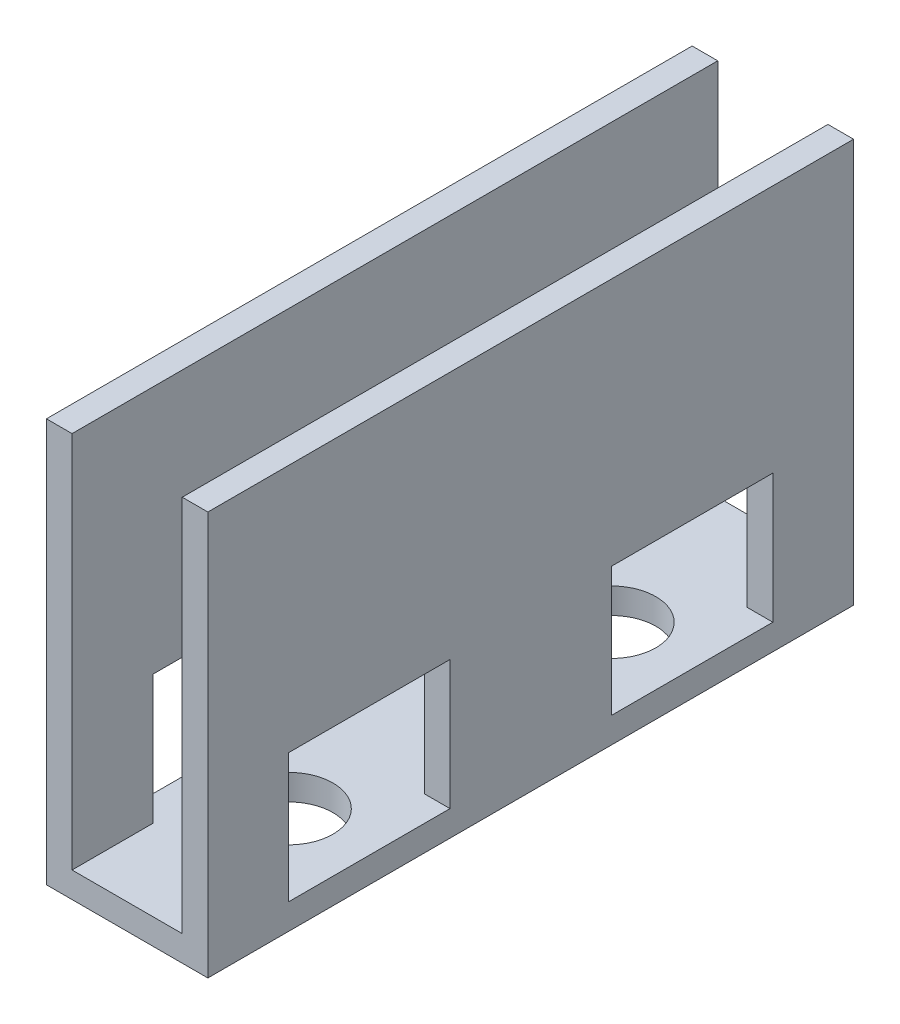
ISO-10303-21;
HEADER;
FILE_DESCRIPTION(('STEP AP214'),'2;1');
FILE_NAME('part.step','',(''),(''),'','','');
FILE_SCHEMA(('AUTOMOTIVE_DESIGN { 1 0 10303 214 1 1 1 1 }'));
ENDSEC;
DATA;
#1=APPLICATION_CONTEXT('core data for automotive mechanical design processes');
#2=APPLICATION_PROTOCOL_DEFINITION('international standard','automotive_design',2000,#1);
#3=PRODUCT_CONTEXT('',#1,'mechanical');
#4=PRODUCT('Part','Part','',(#3));
#5=PRODUCT_RELATED_PRODUCT_CATEGORY('part','',(#4));
#6=PRODUCT_DEFINITION_FORMATION('','',#4);
#7=PRODUCT_DEFINITION_CONTEXT('part definition',#1,'design');
#8=PRODUCT_DEFINITION('design','',#6,#7);
#9=PRODUCT_DEFINITION_SHAPE('','',#8);
#10=(LENGTH_UNIT() NAMED_UNIT(*) SI_UNIT(.MILLI.,.METRE.));
#11=(NAMED_UNIT(*) PLANE_ANGLE_UNIT() SI_UNIT($,.RADIAN.));
#12=(NAMED_UNIT(*) SI_UNIT($,.STERADIAN.) SOLID_ANGLE_UNIT());
#13=UNCERTAINTY_MEASURE_WITH_UNIT(LENGTH_MEASURE(1.E-05),#10,'distance_accuracy_value','');
#14=(GEOMETRIC_REPRESENTATION_CONTEXT(3) GLOBAL_UNCERTAINTY_ASSIGNED_CONTEXT((#13)) GLOBAL_UNIT_ASSIGNED_CONTEXT((#10,
#11,#12)) REPRESENTATION_CONTEXT('',''));
#15=CARTESIAN_POINT('',(0.,0.,0.));
#16=DIRECTION('',(0.,0.,1.));
#17=DIRECTION('',(1.,0.,0.));
#18=AXIS2_PLACEMENT_3D('',#15,#16,#17);
#19=CARTESIAN_POINT('',(0.,1.5875,0.));
#20=DIRECTION('',(0.,1.,0.));
#21=DIRECTION('',(0.,0.,1.));
#22=AXIS2_PLACEMENT_3D('',#19,#20,#21);
#23=PLANE('',#22);
#24=DIRECTION('',(0.,0.,1.));
#25=VECTOR('',#24,1.);
#26=CARTESIAN_POINT('',(-3.4125,1.5875,0.));
#27=LINE('',#26,#25);
#28=CARTESIAN_POINT('',(-3.4125,1.5875,-5.));
#29=VERTEX_POINT('',#28);
#30=CARTESIAN_POINT('',(-3.4125,1.5875,5.));
#31=VERTEX_POINT('',#30);
#32=EDGE_CURVE('E397',#29,#31,#27,.T.);
#33=ORIENTED_EDGE('',*,*,#32,.T.);
#34=DIRECTION('',(1.,0.,0.));
#35=VECTOR('',#34,1.);
#36=CARTESIAN_POINT('',(-5.,1.5875,5.));
#37=LINE('',#36,#35);
#38=CARTESIAN_POINT('',(-5.,1.5875,5.));
#39=VERTEX_POINT('',#38);
#40=EDGE_CURVE('E227',#39,#31,#37,.T.);
#41=ORIENTED_EDGE('',*,*,#40,.F.);
#42=DIRECTION('',(0.,0.,-1.));
#43=VECTOR('',#42,1.);
#44=CARTESIAN_POINT('',(-5.,1.5875,15.));
#45=LINE('',#44,#43);
#46=CARTESIAN_POINT('',(-5.,1.5875,15.));
#47=VERTEX_POINT('',#46);
#48=EDGE_CURVE('E224',#47,#39,#45,.T.);
#49=ORIENTED_EDGE('',*,*,#48,.F.);
#50=DIRECTION('',(1.,0.,0.));
#51=VECTOR('',#50,1.);
#52=CARTESIAN_POINT('',(-5.,1.5875,15.));
#53=LINE('',#52,#51);
#54=CARTESIAN_POINT('',(-3.4125,1.5875,15.));
#55=VERTEX_POINT('',#54);
#56=EDGE_CURVE('E207',#47,#55,#53,.T.);
#57=ORIENTED_EDGE('',*,*,#56,.T.);
#58=CARTESIAN_POINT('',(-3.4125,1.5875,20.));
#59=VERTEX_POINT('',#58);
#60=EDGE_CURVE('E391',#55,#59,#27,.T.);
#61=ORIENTED_EDGE('',*,*,#60,.T.);
#62=DIRECTION('',(1.,0.,0.));
#63=VECTOR('',#62,1.);
#64=CARTESIAN_POINT('',(0.,1.5875,20.));
#65=LINE('',#64,#63);
#66=CARTESIAN_POINT('',(3.4125,1.5875,20.));
#67=VERTEX_POINT('',#66);
#68=EDGE_CURVE('E398',#59,#67,#65,.T.);
#69=ORIENTED_EDGE('',*,*,#68,.T.);
#70=DIRECTION('',(0.,0.,1.));
#71=VECTOR('',#70,1.);
#72=CARTESIAN_POINT('',(3.4125,1.5875,0.));
#73=LINE('',#72,#71);
#74=CARTESIAN_POINT('',(3.4125,1.5875,15.));
#75=VERTEX_POINT('',#74);
#76=EDGE_CURVE('E362',#75,#67,#73,.T.);
#77=ORIENTED_EDGE('',*,*,#76,.F.);
#78=CARTESIAN_POINT('',(5.,1.5875,15.));
#79=VERTEX_POINT('',#78);
#80=EDGE_CURVE('E220',#75,#79,#53,.T.);
#81=ORIENTED_EDGE('',*,*,#80,.T.);
#82=DIRECTION('',(0.,0.,-1.));
#83=VECTOR('',#82,1.);
#84=CARTESIAN_POINT('',(5.,1.5875,15.));
#85=LINE('',#84,#83);
#86=CARTESIAN_POINT('',(5.,1.5875,5.));
#87=VERTEX_POINT('',#86);
#88=EDGE_CURVE('E251',#79,#87,#85,.T.);
#89=ORIENTED_EDGE('',*,*,#88,.T.);
#90=CARTESIAN_POINT('',(3.4125,1.5875,5.));
#91=VERTEX_POINT('',#90);
#92=EDGE_CURVE('E219',#91,#87,#37,.T.);
#93=ORIENTED_EDGE('',*,*,#92,.F.);
#94=CARTESIAN_POINT('',(3.4125,1.5875,-5.));
#95=VERTEX_POINT('',#94);
#96=EDGE_CURVE('E368',#95,#91,#73,.T.);
#97=ORIENTED_EDGE('',*,*,#96,.F.);
#98=DIRECTION('',(1.,0.,0.));
#99=VECTOR('',#98,1.);
#100=CARTESIAN_POINT('',(-5.,1.5875,-5.));
#101=LINE('',#100,#99);
#102=CARTESIAN_POINT('',(5.,1.5875,-5.));
#103=VERTEX_POINT('',#102);
#104=EDGE_CURVE('E284',#95,#103,#101,.T.);
#105=ORIENTED_EDGE('',*,*,#104,.T.);
#106=DIRECTION('',(0.,0.,-1.));
#107=VECTOR('',#106,1.);
#108=CARTESIAN_POINT('',(5.,1.5875,-15.));
#109=LINE('',#108,#107);
#110=CARTESIAN_POINT('',(5.,1.5875,-15.));
#111=VERTEX_POINT('',#110);
#112=EDGE_CURVE('E289',#103,#111,#109,.T.);
#113=ORIENTED_EDGE('',*,*,#112,.T.);
#114=DIRECTION('',(1.,0.,0.));
#115=VECTOR('',#114,1.);
#116=CARTESIAN_POINT('',(-5.,1.5875,-15.));
#117=LINE('',#116,#115);
#118=CARTESIAN_POINT('',(3.4125,1.5875,-15.));
#119=VERTEX_POINT('',#118);
#120=EDGE_CURVE('E288',#119,#111,#117,.T.);
#121=ORIENTED_EDGE('',*,*,#120,.F.);
#122=CARTESIAN_POINT('',(3.4125,1.5875,-20.));
#123=VERTEX_POINT('',#122);
#124=EDGE_CURVE('E363',#123,#119,#73,.T.);
#125=ORIENTED_EDGE('',*,*,#124,.F.);
#126=DIRECTION('',(1.,0.,0.));
#127=VECTOR('',#126,1.);
#128=CARTESIAN_POINT('',(0.,1.5875,-20.));
#129=LINE('',#128,#127);
#130=CARTESIAN_POINT('',(-3.4125,1.5875,-20.));
#131=VERTEX_POINT('',#130);
#132=EDGE_CURVE('E402',#131,#123,#129,.T.);
#133=ORIENTED_EDGE('',*,*,#132,.F.);
#134=CARTESIAN_POINT('',(-3.4125,1.5875,-15.));
#135=VERTEX_POINT('',#134);
#136=EDGE_CURVE('E392',#131,#135,#27,.T.);
#137=ORIENTED_EDGE('',*,*,#136,.T.);
#138=CARTESIAN_POINT('',(-5.,1.5875,-15.));
#139=VERTEX_POINT('',#138);
#140=EDGE_CURVE('E285',#139,#135,#117,.T.);
#141=ORIENTED_EDGE('',*,*,#140,.F.);
#142=DIRECTION('',(0.,0.,-1.));
#143=VECTOR('',#142,1.);
#144=CARTESIAN_POINT('',(-5.,1.5875,-15.));
#145=LINE('',#144,#143);
#146=CARTESIAN_POINT('',(-5.,1.5875,-5.));
#147=VERTEX_POINT('',#146);
#148=EDGE_CURVE('E273',#147,#139,#145,.T.);
#149=ORIENTED_EDGE('',*,*,#148,.F.);
#150=EDGE_CURVE('E280',#147,#29,#101,.T.);
#151=ORIENTED_EDGE('',*,*,#150,.T.);
#152=EDGE_LOOP('',(#33,#41,#49,#57,#61,#69,#77,#81,#89,#93,#97,#105,#113,#121,#125,#133,#137,
#141,#149,#151));
#153=FACE_BOUND('',#152,.T.);
#154=CARTESIAN_POINT('',(0.,1.5875,-10.));
#155=DIRECTION('',(0.,1.,0.));
#156=DIRECTION('',(0.,0.,1.));
#157=AXIS2_PLACEMENT_3D('',#154,#155,#156);
#158=CIRCLE('',#157,2.75);
#159=CARTESIAN_POINT('',(0.,1.5875,-7.25));
#160=VERTEX_POINT('',#159);
#161=EDGE_CURVE('E407',#160,#160,#158,.T.);
#162=ORIENTED_EDGE('',*,*,#161,.F.);
#163=EDGE_LOOP('',(#162));
#164=FACE_BOUND('',#163,.T.);
#165=CARTESIAN_POINT('',(0.,1.5875,10.));
#166=DIRECTION('',(0.,1.,0.));
#167=DIRECTION('',(0.,0.,1.));
#168=AXIS2_PLACEMENT_3D('',#165,#166,#167);
#169=CIRCLE('',#168,2.75);
#170=CARTESIAN_POINT('',(0.,1.5875,12.75));
#171=VERTEX_POINT('',#170);
#172=EDGE_CURVE('E411',#171,#171,#169,.T.);
#173=ORIENTED_EDGE('',*,*,#172,.F.);
#174=EDGE_LOOP('',(#173));
#175=FACE_BOUND('',#174,.T.);
#176=ADVANCED_FACE('F45',(#153,#164,#175),#23,.T.);
#177=CARTESIAN_POINT('',(0.,1.5875,20.));
#178=DIRECTION('',(0.,0.,-1.));
#179=DIRECTION('',(-1.,0.,0.));
#180=AXIS2_PLACEMENT_3D('',#177,#178,#179);
#181=PLANE('',#180);
#182=DIRECTION('',(1.,0.,0.));
#183=VECTOR('',#182,1.);
#184=CARTESIAN_POINT('',(0.,0.,20.));
#185=LINE('',#184,#183);
#186=CARTESIAN_POINT('',(-5.,0.,20.));
#187=VERTEX_POINT('',#186);
#188=CARTESIAN_POINT('',(5.,0.,20.));
#189=VERTEX_POINT('',#188);
#190=EDGE_CURVE('E396',#187,#189,#185,.T.);
#191=ORIENTED_EDGE('',*,*,#190,.T.);
#192=DIRECTION('',(0.,-1.,0.));
#193=VECTOR('',#192,1.);
#194=CARTESIAN_POINT('',(5.,1.5875,20.));
#195=LINE('',#194,#193);
#196=CARTESIAN_POINT('',(5.,25.,20.));
#197=VERTEX_POINT('',#196);
#198=EDGE_CURVE('E445',#197,#189,#195,.T.);
#199=ORIENTED_EDGE('',*,*,#198,.F.);
#200=DIRECTION('',(1.,0.,0.));
#201=VECTOR('',#200,1.);
#202=CARTESIAN_POINT('',(0.,25.,20.));
#203=LINE('',#202,#201);
#204=CARTESIAN_POINT('',(3.4125,25.,20.));
#205=VERTEX_POINT('',#204);
#206=EDGE_CURVE('E343',#205,#197,#203,.T.);
#207=ORIENTED_EDGE('',*,*,#206,.F.);
#208=DIRECTION('',(0.,-1.,0.));
#209=VECTOR('',#208,1.);
#210=CARTESIAN_POINT('',(3.4125,25.,20.));
#211=LINE('',#210,#209);
#212=EDGE_CURVE('E358',#205,#67,#211,.T.);
#213=ORIENTED_EDGE('',*,*,#212,.T.);
#214=ORIENTED_EDGE('',*,*,#68,.F.);
#215=DIRECTION('',(0.,-1.,0.));
#216=VECTOR('',#215,1.);
#217=CARTESIAN_POINT('',(-3.4125,25.,20.));
#218=LINE('',#217,#216);
#219=CARTESIAN_POINT('',(-3.4125,25.,20.));
#220=VERTEX_POINT('',#219);
#221=EDGE_CURVE('E387',#220,#59,#218,.T.);
#222=ORIENTED_EDGE('',*,*,#221,.F.);
#223=DIRECTION('',(1.,0.,0.));
#224=VECTOR('',#223,1.);
#225=CARTESIAN_POINT('',(0.,25.,20.));
#226=LINE('',#225,#224);
#227=CARTESIAN_POINT('',(-5.,25.,20.));
#228=VERTEX_POINT('',#227);
#229=EDGE_CURVE('E367',#228,#220,#226,.T.);
#230=ORIENTED_EDGE('',*,*,#229,.F.);
#231=DIRECTION('',(0.,-1.,0.));
#232=VECTOR('',#231,1.);
#233=CARTESIAN_POINT('',(-5.,1.5875,20.));
#234=LINE('',#233,#232);
#235=EDGE_CURVE('E415',#228,#187,#234,.T.);
#236=ORIENTED_EDGE('',*,*,#235,.T.);
#237=EDGE_LOOP('',(#191,#199,#207,#213,#214,#222,#230,#236));
#238=FACE_BOUND('',#237,.T.);
#239=ADVANCED_FACE('F47',(#238),#181,.F.);
#240=CARTESIAN_POINT('',(5.,1.5875,0.));
#241=DIRECTION('',(-1.,0.,0.));
#242=DIRECTION('',(0.,0.,1.));
#243=AXIS2_PLACEMENT_3D('',#240,#241,#242);
#244=PLANE('',#243);
#245=ORIENTED_EDGE('',*,*,#88,.F.);
#246=DIRECTION('',(0.,-1.,0.));
#247=VECTOR('',#246,1.);
#248=CARTESIAN_POINT('',(5.,1.5875,15.));
#249=LINE('',#248,#247);
#250=CARTESIAN_POINT('',(5.,9.5875,15.));
#251=VERTEX_POINT('',#250);
#252=EDGE_CURVE('E61',#251,#79,#249,.T.);
#253=ORIENTED_EDGE('',*,*,#252,.F.);
#254=DIRECTION('',(0.,0.,1.));
#255=VECTOR('',#254,1.);
#256=CARTESIAN_POINT('',(5.,9.5875,15.));
#257=LINE('',#256,#255);
#258=CARTESIAN_POINT('',(5.,9.5875,5.));
#259=VERTEX_POINT('',#258);
#260=EDGE_CURVE('E238',#259,#251,#257,.T.);
#261=ORIENTED_EDGE('',*,*,#260,.F.);
#262=DIRECTION('',(0.,1.,0.));
#263=VECTOR('',#262,1.);
#264=CARTESIAN_POINT('',(5.,1.5875,5.));
#265=LINE('',#264,#263);
#266=EDGE_CURVE('E242',#87,#259,#265,.T.);
#267=ORIENTED_EDGE('',*,*,#266,.F.);
#268=EDGE_LOOP('',(#245,#253,#261,#267));
#269=FACE_BOUND('',#268,.T.);
#270=DIRECTION('',(0.,0.,1.));
#271=VECTOR('',#270,1.);
#272=CARTESIAN_POINT('',(5.,9.5875,-15.));
#273=LINE('',#272,#271);
#274=CARTESIAN_POINT('',(5.,9.5875,-15.));
#275=VERTEX_POINT('',#274);
#276=CARTESIAN_POINT('',(5.,9.5875,-5.));
#277=VERTEX_POINT('',#276);
#278=EDGE_CURVE('E298',#275,#277,#273,.T.);
#279=ORIENTED_EDGE('',*,*,#278,.F.);
#280=DIRECTION('',(0.,1.,0.));
#281=VECTOR('',#280,1.);
#282=CARTESIAN_POINT('',(5.,1.5875,-15.));
#283=LINE('',#282,#281);
#284=EDGE_CURVE('E69',#111,#275,#283,.T.);
#285=ORIENTED_EDGE('',*,*,#284,.F.);
#286=ORIENTED_EDGE('',*,*,#112,.F.);
#287=DIRECTION('',(0.,-1.,0.));
#288=VECTOR('',#287,1.);
#289=CARTESIAN_POINT('',(5.,1.5875,-5.));
#290=LINE('',#289,#288);
#291=EDGE_CURVE('E293',#277,#103,#290,.T.);
#292=ORIENTED_EDGE('',*,*,#291,.F.);
#293=EDGE_LOOP('',(#279,#285,#286,#292));
#294=FACE_BOUND('',#293,.T.);
#295=DIRECTION('',(0.,0.,-1.));
#296=VECTOR('',#295,1.);
#297=CARTESIAN_POINT('',(5.,0.,0.));
#298=LINE('',#297,#296);
#299=CARTESIAN_POINT('',(5.,0.,-20.));
#300=VERTEX_POINT('',#299);
#301=EDGE_CURVE('E418',#189,#300,#298,.T.);
#302=ORIENTED_EDGE('',*,*,#301,.T.);
#303=DIRECTION('',(0.,-1.,0.));
#304=VECTOR('',#303,1.);
#305=CARTESIAN_POINT('',(5.,1.5875,-20.));
#306=LINE('',#305,#304);
#307=CARTESIAN_POINT('',(5.,25.,-20.));
#308=VERTEX_POINT('',#307);
#309=EDGE_CURVE('E441',#308,#300,#306,.T.);
#310=ORIENTED_EDGE('',*,*,#309,.F.);
#311=DIRECTION('',(0.,0.,-1.));
#312=VECTOR('',#311,1.);
#313=CARTESIAN_POINT('',(5.,25.,0.));
#314=LINE('',#313,#312);
#315=EDGE_CURVE('E347',#197,#308,#314,.T.);
#316=ORIENTED_EDGE('',*,*,#315,.F.);
#317=ORIENTED_EDGE('',*,*,#198,.T.);
#318=EDGE_LOOP('',(#302,#310,#316,#317));
#319=FACE_BOUND('',#318,.T.);
#320=ADVANCED_FACE('F511',(#269,#294,#319),#244,.F.);
#321=CARTESIAN_POINT('',(0.,1.5875,-20.));
#322=DIRECTION('',(0.,0.,-1.));
#323=DIRECTION('',(-1.,0.,0.));
#324=AXIS2_PLACEMENT_3D('',#321,#322,#323);
#325=PLANE('',#324);
#326=ORIENTED_EDGE('',*,*,#132,.T.);
#327=DIRECTION('',(0.,-1.,0.));
#328=VECTOR('',#327,1.);
#329=CARTESIAN_POINT('',(3.4125,25.,-20.));
#330=LINE('',#329,#328);
#331=CARTESIAN_POINT('',(3.4125,25.,-20.));
#332=VERTEX_POINT('',#331);
#333=EDGE_CURVE('E355',#332,#123,#330,.T.);
#334=ORIENTED_EDGE('',*,*,#333,.F.);
#335=DIRECTION('',(1.,0.,0.));
#336=VECTOR('',#335,1.);
#337=CARTESIAN_POINT('',(0.,25.,-20.));
#338=LINE('',#337,#336);
#339=EDGE_CURVE('E351',#332,#308,#338,.T.);
#340=ORIENTED_EDGE('',*,*,#339,.T.);
#341=ORIENTED_EDGE('',*,*,#309,.T.);
#342=DIRECTION('',(1.,0.,0.));
#343=VECTOR('',#342,1.);
#344=CARTESIAN_POINT('',(0.,0.,-20.));
#345=LINE('',#344,#343);
#346=CARTESIAN_POINT('',(-5.,0.,-20.));
#347=VERTEX_POINT('',#346);
#348=EDGE_CURVE('E422',#347,#300,#345,.T.);
#349=ORIENTED_EDGE('',*,*,#348,.F.);
#350=DIRECTION('',(0.,-1.,0.));
#351=VECTOR('',#350,1.);
#352=CARTESIAN_POINT('',(-5.,1.5875,-20.));
#353=LINE('',#352,#351);
#354=CARTESIAN_POINT('',(-5.,25.,-20.));
#355=VERTEX_POINT('',#354);
#356=EDGE_CURVE('E438',#355,#347,#353,.T.);
#357=ORIENTED_EDGE('',*,*,#356,.F.);
#358=DIRECTION('',(1.,0.,0.));
#359=VECTOR('',#358,1.);
#360=CARTESIAN_POINT('',(0.,25.,-20.));
#361=LINE('',#360,#359);
#362=CARTESIAN_POINT('',(-3.4125,25.,-20.));
#363=VERTEX_POINT('',#362);
#364=EDGE_CURVE('E375',#355,#363,#361,.T.);
#365=ORIENTED_EDGE('',*,*,#364,.T.);
#366=DIRECTION('',(0.,-1.,0.));
#367=VECTOR('',#366,1.);
#368=CARTESIAN_POINT('',(-3.4125,25.,-20.));
#369=LINE('',#368,#367);
#370=EDGE_CURVE('E383',#363,#131,#369,.T.);
#371=ORIENTED_EDGE('',*,*,#370,.T.);
#372=EDGE_LOOP('',(#326,#334,#340,#341,#349,#357,#365,#371));
#373=FACE_BOUND('',#372,.T.);
#374=ADVANCED_FACE('F513',(#373),#325,.T.);
#375=CARTESIAN_POINT('',(0.,1.5875,-10.));
#376=DIRECTION('',(0.,-1.,0.));
#377=DIRECTION('',(0.,0.,-1.));
#378=AXIS2_PLACEMENT_3D('',#375,#376,#377);
#379=CYLINDRICAL_SURFACE('',#378,2.75);
#380=ORIENTED_EDGE('',*,*,#161,.T.);
#381=EDGE_LOOP('',(#380));
#382=FACE_BOUND('',#381,.T.);
#383=CARTESIAN_POINT('',(0.,0.,-10.));
#384=DIRECTION('',(0.,1.,0.));
#385=DIRECTION('',(0.,0.,1.));
#386=AXIS2_PLACEMENT_3D('',#383,#384,#385);
#387=CIRCLE('',#386,2.75);
#388=CARTESIAN_POINT('',(0.,0.,-7.25));
#389=VERTEX_POINT('',#388);
#390=EDGE_CURVE('E429',#389,#389,#387,.T.);
#391=ORIENTED_EDGE('',*,*,#390,.F.);
#392=EDGE_LOOP('',(#391));
#393=FACE_BOUND('',#392,.T.);
#394=ADVANCED_FACE('F561',(#382,#393),#379,.F.);
#395=CARTESIAN_POINT('',(-5.,1.5875,0.));
#396=DIRECTION('',(-1.,0.,0.));
#397=DIRECTION('',(0.,0.,1.));
#398=AXIS2_PLACEMENT_3D('',#395,#396,#397);
#399=PLANE('',#398);
#400=DIRECTION('',(0.,-1.,0.));
#401=VECTOR('',#400,1.);
#402=CARTESIAN_POINT('',(-5.,1.5875,15.));
#403=LINE('',#402,#401);
#404=CARTESIAN_POINT('',(-5.,9.5875,15.));
#405=VERTEX_POINT('',#404);
#406=EDGE_CURVE('E212',#405,#47,#403,.T.);
#407=ORIENTED_EDGE('',*,*,#406,.T.);
#408=ORIENTED_EDGE('',*,*,#48,.T.);
#409=DIRECTION('',(0.,1.,0.));
#410=VECTOR('',#409,1.);
#411=CARTESIAN_POINT('',(-5.,1.5875,5.));
#412=LINE('',#411,#410);
#413=CARTESIAN_POINT('',(-5.,9.5875,5.));
#414=VERTEX_POINT('',#413);
#415=EDGE_CURVE('E231',#39,#414,#412,.T.);
#416=ORIENTED_EDGE('',*,*,#415,.T.);
#417=DIRECTION('',(0.,0.,1.));
#418=VECTOR('',#417,1.);
#419=CARTESIAN_POINT('',(-5.,9.5875,15.));
#420=LINE('',#419,#418);
#421=EDGE_CURVE('E236',#414,#405,#420,.T.);
#422=ORIENTED_EDGE('',*,*,#421,.T.);
#423=EDGE_LOOP('',(#407,#408,#416,#422));
#424=FACE_BOUND('',#423,.T.);
#425=DIRECTION('',(0.,1.,0.));
#426=VECTOR('',#425,1.);
#427=CARTESIAN_POINT('',(-5.,1.5875,-15.));
#428=LINE('',#427,#426);
#429=CARTESIAN_POINT('',(-5.,9.5875,-15.));
#430=VERTEX_POINT('',#429);
#431=EDGE_CURVE('E294',#139,#430,#428,.T.);
#432=ORIENTED_EDGE('',*,*,#431,.T.);
#433=DIRECTION('',(0.,0.,1.));
#434=VECTOR('',#433,1.);
#435=CARTESIAN_POINT('',(-5.,9.5875,-15.));
#436=LINE('',#435,#434);
#437=CARTESIAN_POINT('',(-5.,9.5875,-5.));
#438=VERTEX_POINT('',#437);
#439=EDGE_CURVE('E311',#430,#438,#436,.T.);
#440=ORIENTED_EDGE('',*,*,#439,.T.);
#441=DIRECTION('',(0.,-1.,0.));
#442=VECTOR('',#441,1.);
#443=CARTESIAN_POINT('',(-5.,1.5875,-5.));
#444=LINE('',#443,#442);
#445=EDGE_CURVE('E307',#438,#147,#444,.T.);
#446=ORIENTED_EDGE('',*,*,#445,.T.);
#447=ORIENTED_EDGE('',*,*,#148,.T.);
#448=EDGE_LOOP('',(#432,#440,#446,#447));
#449=FACE_BOUND('',#448,.T.);
#450=DIRECTION('',(0.,0.,-1.));
#451=VECTOR('',#450,1.);
#452=CARTESIAN_POINT('',(-5.,0.,0.));
#453=LINE('',#452,#451);
#454=EDGE_CURVE('E425',#187,#347,#453,.T.);
#455=ORIENTED_EDGE('',*,*,#454,.F.);
#456=ORIENTED_EDGE('',*,*,#235,.F.);
#457=DIRECTION('',(0.,0.,-1.));
#458=VECTOR('',#457,1.);
#459=CARTESIAN_POINT('',(-5.,25.,0.));
#460=LINE('',#459,#458);
#461=EDGE_CURVE('E379',#228,#355,#460,.T.);
#462=ORIENTED_EDGE('',*,*,#461,.T.);
#463=ORIENTED_EDGE('',*,*,#356,.T.);
#464=EDGE_LOOP('',(#455,#456,#462,#463));
#465=FACE_BOUND('',#464,.T.);
#466=ADVANCED_FACE('F233',(#424,#449,#465),#399,.T.);
#467=CARTESIAN_POINT('',(0.,1.5875,10.));
#468=DIRECTION('',(0.,-1.,0.));
#469=DIRECTION('',(0.,0.,-1.));
#470=AXIS2_PLACEMENT_3D('',#467,#468,#469);
#471=CYLINDRICAL_SURFACE('',#470,2.75);
#472=ORIENTED_EDGE('',*,*,#172,.T.);
#473=EDGE_LOOP('',(#472));
#474=FACE_BOUND('',#473,.T.);
#475=CARTESIAN_POINT('',(0.,0.,10.));
#476=DIRECTION('',(0.,1.,0.));
#477=DIRECTION('',(0.,0.,1.));
#478=AXIS2_PLACEMENT_3D('',#475,#476,#477);
#479=CIRCLE('',#478,2.75);
#480=CARTESIAN_POINT('',(0.,0.,12.75));
#481=VERTEX_POINT('',#480);
#482=EDGE_CURVE('E403',#481,#481,#479,.T.);
#483=ORIENTED_EDGE('',*,*,#482,.F.);
#484=EDGE_LOOP('',(#483));
#485=FACE_BOUND('',#484,.T.);
#486=ADVANCED_FACE('F557',(#474,#485),#471,.F.);
#487=CARTESIAN_POINT('',(0.,0.,0.));
#488=DIRECTION('',(0.,1.,0.));
#489=DIRECTION('',(0.,0.,1.));
#490=AXIS2_PLACEMENT_3D('',#487,#488,#489);
#491=PLANE('',#490);
#492=ORIENTED_EDGE('',*,*,#348,.T.);
#493=ORIENTED_EDGE('',*,*,#301,.F.);
#494=ORIENTED_EDGE('',*,*,#190,.F.);
#495=ORIENTED_EDGE('',*,*,#454,.T.);
#496=EDGE_LOOP('',(#492,#493,#494,#495));
#497=FACE_BOUND('',#496,.T.);
#498=ORIENTED_EDGE('',*,*,#482,.T.);
#499=EDGE_LOOP('',(#498));
#500=FACE_BOUND('',#499,.T.);
#501=ORIENTED_EDGE('',*,*,#390,.T.);
#502=EDGE_LOOP('',(#501));
#503=FACE_BOUND('',#502,.T.);
#504=ADVANCED_FACE('F503',(#497,#500,#503),#491,.F.);
#505=CARTESIAN_POINT('',(-3.4125,25.,0.));
#506=DIRECTION('',(-1.,0.,0.));
#507=DIRECTION('',(0.,0.,1.));
#508=AXIS2_PLACEMENT_3D('',#505,#506,#507);
#509=PLANE('',#508);
#510=ORIENTED_EDGE('',*,*,#60,.F.);
#511=DIRECTION('',(0.,1.,0.));
#512=VECTOR('',#511,1.);
#513=CARTESIAN_POINT('',(-3.4125,25.,15.));
#514=LINE('',#513,#512);
#515=CARTESIAN_POINT('',(-3.4125,9.5875,15.));
#516=VERTEX_POINT('',#515);
#517=EDGE_CURVE('E215',#55,#516,#514,.T.);
#518=ORIENTED_EDGE('',*,*,#517,.T.);
#519=DIRECTION('',(0.,0.,-1.));
#520=VECTOR('',#519,1.);
#521=CARTESIAN_POINT('',(-3.4125,9.5875,0.));
#522=LINE('',#521,#520);
#523=CARTESIAN_POINT('',(-3.4125,9.5875,5.));
#524=VERTEX_POINT('',#523);
#525=EDGE_CURVE('E333',#516,#524,#522,.T.);
#526=ORIENTED_EDGE('',*,*,#525,.T.);
#527=DIRECTION('',(0.,-1.,0.));
#528=VECTOR('',#527,1.);
#529=CARTESIAN_POINT('',(-3.4125,25.,5.));
#530=LINE('',#529,#528);
#531=EDGE_CURVE('E329',#524,#31,#530,.T.);
#532=ORIENTED_EDGE('',*,*,#531,.T.);
#533=ORIENTED_EDGE('',*,*,#32,.F.);
#534=DIRECTION('',(0.,1.,0.));
#535=VECTOR('',#534,1.);
#536=CARTESIAN_POINT('',(-3.4125,25.,-5.));
#537=LINE('',#536,#535);
#538=CARTESIAN_POINT('',(-3.4125,9.5875,-5.));
#539=VERTEX_POINT('',#538);
#540=EDGE_CURVE('E321',#29,#539,#537,.T.);
#541=ORIENTED_EDGE('',*,*,#540,.T.);
#542=DIRECTION('',(0.,0.,-1.));
#543=VECTOR('',#542,1.);
#544=CARTESIAN_POINT('',(-3.4125,9.5875,0.));
#545=LINE('',#544,#543);
#546=CARTESIAN_POINT('',(-3.4125,9.5875,-15.));
#547=VERTEX_POINT('',#546);
#548=EDGE_CURVE('E261',#539,#547,#545,.T.);
#549=ORIENTED_EDGE('',*,*,#548,.T.);
#550=DIRECTION('',(0.,-1.,0.));
#551=VECTOR('',#550,1.);
#552=CARTESIAN_POINT('',(-3.4125,25.,-15.));
#553=LINE('',#552,#551);
#554=EDGE_CURVE('E325',#547,#135,#553,.T.);
#555=ORIENTED_EDGE('',*,*,#554,.T.);
#556=ORIENTED_EDGE('',*,*,#136,.F.);
#557=ORIENTED_EDGE('',*,*,#370,.F.);
#558=DIRECTION('',(0.,0.,-1.));
#559=VECTOR('',#558,1.);
#560=CARTESIAN_POINT('',(-3.4125,25.,0.));
#561=LINE('',#560,#559);
#562=EDGE_CURVE('E372',#220,#363,#561,.T.);
#563=ORIENTED_EDGE('',*,*,#562,.F.);
#564=ORIENTED_EDGE('',*,*,#221,.T.);
#565=EDGE_LOOP('',(#510,#518,#526,#532,#533,#541,#549,#555,#556,#557,#563,#564));
#566=FACE_BOUND('',#565,.T.);
#567=ADVANCED_FACE('F491',(#566),#509,.F.);
#568=CARTESIAN_POINT('',(0.,25.,0.));
#569=DIRECTION('',(0.,1.,0.));
#570=DIRECTION('',(0.,0.,1.));
#571=AXIS2_PLACEMENT_3D('',#568,#569,#570);
#572=PLANE('',#571);
#573=ORIENTED_EDGE('',*,*,#229,.T.);
#574=ORIENTED_EDGE('',*,*,#562,.T.);
#575=ORIENTED_EDGE('',*,*,#364,.F.);
#576=ORIENTED_EDGE('',*,*,#461,.F.);
#577=EDGE_LOOP('',(#573,#574,#575,#576));
#578=FACE_BOUND('',#577,.T.);
#579=ADVANCED_FACE('F498',(#578),#572,.T.);
#580=CARTESIAN_POINT('',(3.4125,25.,0.));
#581=DIRECTION('',(-1.,0.,0.));
#582=DIRECTION('',(0.,0.,1.));
#583=AXIS2_PLACEMENT_3D('',#580,#581,#582);
#584=PLANE('',#583);
#585=DIRECTION('',(0.,1.,0.));
#586=VECTOR('',#585,1.);
#587=CARTESIAN_POINT('',(3.4125,25.,15.));
#588=LINE('',#587,#586);
#589=CARTESIAN_POINT('',(3.4125,9.5875,15.));
#590=VERTEX_POINT('',#589);
#591=EDGE_CURVE('E11',#75,#590,#588,.T.);
#592=ORIENTED_EDGE('',*,*,#591,.F.);
#593=ORIENTED_EDGE('',*,*,#76,.T.);
#594=ORIENTED_EDGE('',*,*,#212,.F.);
#595=DIRECTION('',(0.,0.,-1.));
#596=VECTOR('',#595,1.);
#597=CARTESIAN_POINT('',(3.4125,25.,0.));
#598=LINE('',#597,#596);
#599=EDGE_CURVE('E339',#205,#332,#598,.T.);
#600=ORIENTED_EDGE('',*,*,#599,.T.);
#601=ORIENTED_EDGE('',*,*,#333,.T.);
#602=ORIENTED_EDGE('',*,*,#124,.T.);
#603=DIRECTION('',(0.,-1.,0.));
#604=VECTOR('',#603,1.);
#605=CARTESIAN_POINT('',(3.4125,25.,-15.));
#606=LINE('',#605,#604);
#607=CARTESIAN_POINT('',(3.4125,9.5875,-15.));
#608=VERTEX_POINT('',#607);
#609=EDGE_CURVE('E456',#608,#119,#606,.T.);
#610=ORIENTED_EDGE('',*,*,#609,.F.);
#611=DIRECTION('',(0.,0.,-1.));
#612=VECTOR('',#611,1.);
#613=CARTESIAN_POINT('',(3.4125,9.5875,0.));
#614=LINE('',#613,#612);
#615=CARTESIAN_POINT('',(3.4125,9.5875,-5.));
#616=VERTEX_POINT('',#615);
#617=EDGE_CURVE('E449',#616,#608,#614,.T.);
#618=ORIENTED_EDGE('',*,*,#617,.F.);
#619=DIRECTION('',(0.,1.,0.));
#620=VECTOR('',#619,1.);
#621=CARTESIAN_POINT('',(3.4125,25.,-5.));
#622=LINE('',#621,#620);
#623=EDGE_CURVE('E452',#95,#616,#622,.T.);
#624=ORIENTED_EDGE('',*,*,#623,.F.);
#625=ORIENTED_EDGE('',*,*,#96,.T.);
#626=DIRECTION('',(0.,-1.,0.));
#627=VECTOR('',#626,1.);
#628=CARTESIAN_POINT('',(3.4125,25.,5.));
#629=LINE('',#628,#627);
#630=CARTESIAN_POINT('',(3.4125,9.5875,5.));
#631=VERTEX_POINT('',#630);
#632=EDGE_CURVE('E459',#631,#91,#629,.T.);
#633=ORIENTED_EDGE('',*,*,#632,.F.);
#634=DIRECTION('',(0.,0.,-1.));
#635=VECTOR('',#634,1.);
#636=CARTESIAN_POINT('',(3.4125,9.5875,0.));
#637=LINE('',#636,#635);
#638=EDGE_CURVE('E54',#590,#631,#637,.T.);
#639=ORIENTED_EDGE('',*,*,#638,.F.);
#640=EDGE_LOOP('',(#592,#593,#594,#600,#601,#602,#610,#618,#624,#625,#633,#639));
#641=FACE_BOUND('',#640,.T.);
#642=ADVANCED_FACE('F477',(#641),#584,.T.);
#643=CARTESIAN_POINT('',(0.,25.,0.));
#644=DIRECTION('',(0.,1.,0.));
#645=DIRECTION('',(0.,0.,1.));
#646=AXIS2_PLACEMENT_3D('',#643,#644,#645);
#647=PLANE('',#646);
#648=ORIENTED_EDGE('',*,*,#599,.F.);
#649=ORIENTED_EDGE('',*,*,#206,.T.);
#650=ORIENTED_EDGE('',*,*,#315,.T.);
#651=ORIENTED_EDGE('',*,*,#339,.F.);
#652=EDGE_LOOP('',(#648,#649,#650,#651));
#653=FACE_BOUND('',#652,.T.);
#654=ADVANCED_FACE('F509',(#653),#647,.T.);
#655=CARTESIAN_POINT('',(-5.,9.5875,-15.));
#656=DIRECTION('',(0.,1.,0.));
#657=DIRECTION('',(0.,0.,1.));
#658=AXIS2_PLACEMENT_3D('',#655,#656,#657);
#659=PLANE('',#658);
#660=ORIENTED_EDGE('',*,*,#617,.T.);
#661=DIRECTION('',(1.,0.,0.));
#662=VECTOR('',#661,1.);
#663=CARTESIAN_POINT('',(-5.,9.5875,-15.));
#664=LINE('',#663,#662);
#665=EDGE_CURVE('E274',#608,#275,#664,.T.);
#666=ORIENTED_EDGE('',*,*,#665,.T.);
#667=ORIENTED_EDGE('',*,*,#278,.T.);
#668=DIRECTION('',(1.,0.,0.));
#669=VECTOR('',#668,1.);
#670=CARTESIAN_POINT('',(-5.,9.5875,-5.));
#671=LINE('',#670,#669);
#672=EDGE_CURVE('E279',#616,#277,#671,.T.);
#673=ORIENTED_EDGE('',*,*,#672,.F.);
#674=EDGE_LOOP('',(#660,#666,#667,#673));
#675=FACE_BOUND('',#674,.T.);
#676=ADVANCED_FACE('F525',(#675),#659,.F.);
#677=CARTESIAN_POINT('',(-5.,1.5875,-5.));
#678=DIRECTION('',(0.,0.,1.));
#679=DIRECTION('',(1.,0.,0.));
#680=AXIS2_PLACEMENT_3D('',#677,#678,#679);
#681=PLANE('',#680);
#682=ORIENTED_EDGE('',*,*,#623,.T.);
#683=ORIENTED_EDGE('',*,*,#672,.T.);
#684=ORIENTED_EDGE('',*,*,#291,.T.);
#685=ORIENTED_EDGE('',*,*,#104,.F.);
#686=EDGE_LOOP('',(#682,#683,#684,#685));
#687=FACE_BOUND('',#686,.T.);
#688=ADVANCED_FACE('F529',(#687),#681,.F.);
#689=CARTESIAN_POINT('',(-5.,1.5875,-15.));
#690=DIRECTION('',(0.,0.,-1.));
#691=DIRECTION('',(0.,1.,0.));
#692=AXIS2_PLACEMENT_3D('',#689,#690,#691);
#693=PLANE('',#692);
#694=ORIENTED_EDGE('',*,*,#609,.T.);
#695=ORIENTED_EDGE('',*,*,#120,.T.);
#696=ORIENTED_EDGE('',*,*,#284,.T.);
#697=ORIENTED_EDGE('',*,*,#665,.F.);
#698=EDGE_LOOP('',(#694,#695,#696,#697));
#699=FACE_BOUND('',#698,.T.);
#700=ADVANCED_FACE('F530',(#699),#693,.F.);
#701=CARTESIAN_POINT('',(-5.,1.5875,5.));
#702=DIRECTION('',(0.,0.,-1.));
#703=DIRECTION('',(-1.,0.,0.));
#704=AXIS2_PLACEMENT_3D('',#701,#702,#703);
#705=PLANE('',#704);
#706=ORIENTED_EDGE('',*,*,#632,.T.);
#707=ORIENTED_EDGE('',*,*,#92,.T.);
#708=ORIENTED_EDGE('',*,*,#266,.T.);
#709=DIRECTION('',(1.,0.,0.));
#710=VECTOR('',#709,1.);
#711=CARTESIAN_POINT('',(-5.,9.5875,5.));
#712=LINE('',#711,#710);
#713=EDGE_CURVE('E267',#631,#259,#712,.T.);
#714=ORIENTED_EDGE('',*,*,#713,.F.);
#715=EDGE_LOOP('',(#706,#707,#708,#714));
#716=FACE_BOUND('',#715,.T.);
#717=ADVANCED_FACE('F472',(#716),#705,.F.);
#718=CARTESIAN_POINT('',(-5.,9.5875,15.));
#719=DIRECTION('',(0.,1.,0.));
#720=DIRECTION('',(0.,0.,1.));
#721=AXIS2_PLACEMENT_3D('',#718,#719,#720);
#722=PLANE('',#721);
#723=ORIENTED_EDGE('',*,*,#638,.T.);
#724=ORIENTED_EDGE('',*,*,#713,.T.);
#725=ORIENTED_EDGE('',*,*,#260,.T.);
#726=DIRECTION('',(1.,0.,0.));
#727=VECTOR('',#726,1.);
#728=CARTESIAN_POINT('',(-5.,9.5875,15.));
#729=LINE('',#728,#727);
#730=EDGE_CURVE('E262',#590,#251,#729,.T.);
#731=ORIENTED_EDGE('',*,*,#730,.F.);
#732=EDGE_LOOP('',(#723,#724,#725,#731));
#733=FACE_BOUND('',#732,.T.);
#734=ADVANCED_FACE('F467',(#733),#722,.F.);
#735=CARTESIAN_POINT('',(-5.,1.5875,15.));
#736=DIRECTION('',(0.,0.,1.));
#737=DIRECTION('',(0.,-1.,0.));
#738=AXIS2_PLACEMENT_3D('',#735,#736,#737);
#739=PLANE('',#738);
#740=ORIENTED_EDGE('',*,*,#591,.T.);
#741=ORIENTED_EDGE('',*,*,#730,.T.);
#742=ORIENTED_EDGE('',*,*,#252,.T.);
#743=ORIENTED_EDGE('',*,*,#80,.F.);
#744=EDGE_LOOP('',(#740,#741,#742,#743));
#745=FACE_BOUND('',#744,.T.);
#746=ADVANCED_FACE('F545',(#745),#739,.F.);
#747=EDGE_CURVE('E270',#430,#547,#664,.T.);
#748=ORIENTED_EDGE('',*,*,#747,.F.);
#749=ORIENTED_EDGE('',*,*,#431,.F.);
#750=ORIENTED_EDGE('',*,*,#140,.T.);
#751=ORIENTED_EDGE('',*,*,#554,.F.);
#752=EDGE_LOOP('',(#748,#749,#750,#751));
#753=FACE_BOUND('',#752,.T.);
#754=ADVANCED_FACE('F533',(#753),#693,.F.);
#755=ORIENTED_EDGE('',*,*,#150,.F.);
#756=ORIENTED_EDGE('',*,*,#445,.F.);
#757=EDGE_CURVE('E275',#438,#539,#671,.T.);
#758=ORIENTED_EDGE('',*,*,#757,.T.);
#759=ORIENTED_EDGE('',*,*,#540,.F.);
#760=EDGE_LOOP('',(#755,#756,#758,#759));
#761=FACE_BOUND('',#760,.T.);
#762=ADVANCED_FACE('F541',(#761),#681,.F.);
#763=ORIENTED_EDGE('',*,*,#757,.F.);
#764=ORIENTED_EDGE('',*,*,#439,.F.);
#765=ORIENTED_EDGE('',*,*,#747,.T.);
#766=ORIENTED_EDGE('',*,*,#548,.F.);
#767=EDGE_LOOP('',(#763,#764,#765,#766));
#768=FACE_BOUND('',#767,.T.);
#769=ADVANCED_FACE('F583',(#768),#659,.F.);
#770=ORIENTED_EDGE('',*,*,#56,.F.);
#771=ORIENTED_EDGE('',*,*,#406,.F.);
#772=EDGE_CURVE('E258',#405,#516,#729,.T.);
#773=ORIENTED_EDGE('',*,*,#772,.T.);
#774=ORIENTED_EDGE('',*,*,#517,.F.);
#775=EDGE_LOOP('',(#770,#771,#773,#774));
#776=FACE_BOUND('',#775,.T.);
#777=ADVANCED_FACE('F209',(#776),#739,.F.);
#778=ORIENTED_EDGE('',*,*,#772,.F.);
#779=ORIENTED_EDGE('',*,*,#421,.F.);
#780=EDGE_CURVE('E263',#414,#524,#712,.T.);
#781=ORIENTED_EDGE('',*,*,#780,.T.);
#782=ORIENTED_EDGE('',*,*,#525,.F.);
#783=EDGE_LOOP('',(#778,#779,#781,#782));
#784=FACE_BOUND('',#783,.T.);
#785=ADVANCED_FACE('F581',(#784),#722,.F.);
#786=ORIENTED_EDGE('',*,*,#780,.F.);
#787=ORIENTED_EDGE('',*,*,#415,.F.);
#788=ORIENTED_EDGE('',*,*,#40,.T.);
#789=ORIENTED_EDGE('',*,*,#531,.F.);
#790=EDGE_LOOP('',(#786,#787,#788,#789));
#791=FACE_BOUND('',#790,.T.);
#792=ADVANCED_FACE('F539',(#791),#705,.F.);
#793=CLOSED_SHELL('',(#176,#239,#320,#374,#394,#466,#486,#504,#567,#579,#642,#654,#676,#688,
#700,#717,#734,#746,#754,#762,#769,#777,#785,#792));
#794=MANIFOLD_SOLID_BREP('B2',#793);
#795=ADVANCED_BREP_SHAPE_REPRESENTATION('',(#18,#794),#14);
#796=SHAPE_DEFINITION_REPRESENTATION(#9,#795);
ENDSEC;
END-ISO-10303-21;
